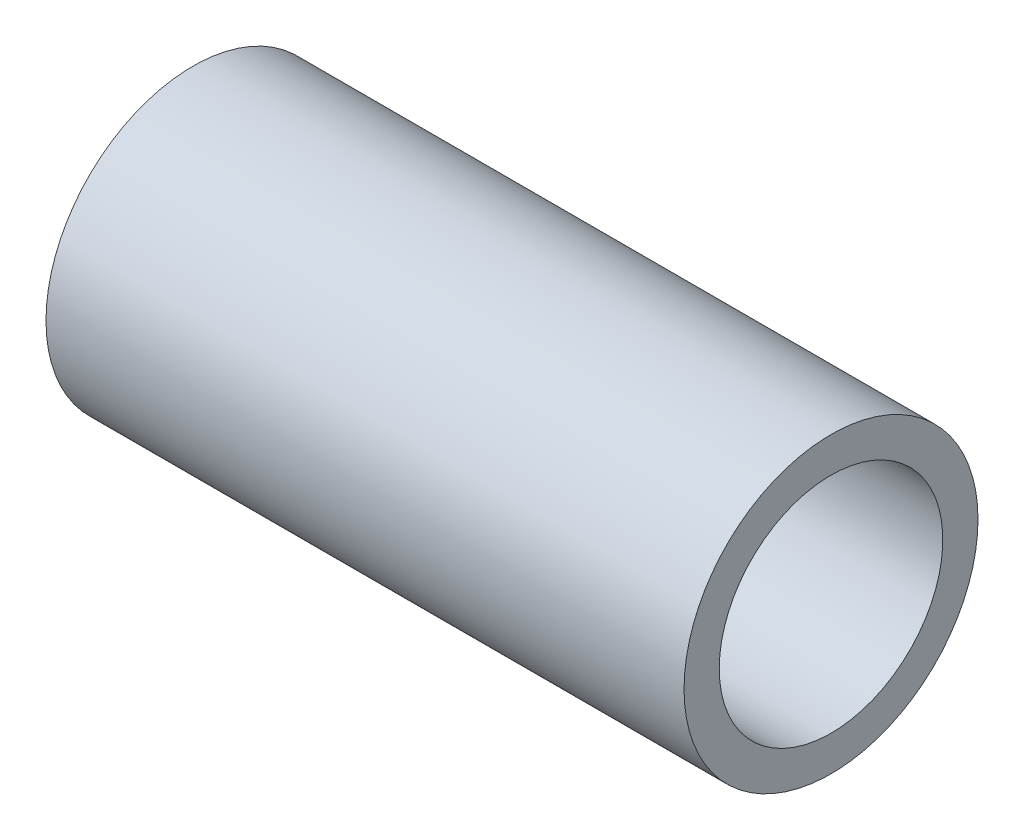
ISO-10303-21;
HEADER;
FILE_DESCRIPTION(('STEP AP214'),'2;1');
FILE_NAME('part.step','',(''),(''),'','','');
FILE_SCHEMA(('AUTOMOTIVE_DESIGN { 1 0 10303 214 1 1 1 1 }'));
ENDSEC;
DATA;
#1=APPLICATION_CONTEXT('core data for automotive mechanical design processes');
#2=APPLICATION_PROTOCOL_DEFINITION('international standard','automotive_design',2000,#1);
#3=PRODUCT_CONTEXT('',#1,'mechanical');
#4=PRODUCT('Part','Part','',(#3));
#5=PRODUCT_RELATED_PRODUCT_CATEGORY('part','',(#4));
#6=PRODUCT_DEFINITION_FORMATION('','',#4);
#7=PRODUCT_DEFINITION_CONTEXT('part definition',#1,'design');
#8=PRODUCT_DEFINITION('design','',#6,#7);
#9=PRODUCT_DEFINITION_SHAPE('','',#8);
#10=(LENGTH_UNIT() NAMED_UNIT(*) SI_UNIT(.MILLI.,.METRE.));
#11=(NAMED_UNIT(*) PLANE_ANGLE_UNIT() SI_UNIT($,.RADIAN.));
#12=(NAMED_UNIT(*) SI_UNIT($,.STERADIAN.) SOLID_ANGLE_UNIT());
#13=UNCERTAINTY_MEASURE_WITH_UNIT(LENGTH_MEASURE(1.E-05),#10,'distance_accuracy_value','');
#14=(GEOMETRIC_REPRESENTATION_CONTEXT(3) GLOBAL_UNCERTAINTY_ASSIGNED_CONTEXT((#13)) GLOBAL_UNIT_ASSIGNED_CONTEXT((#10,
#11,#12)) REPRESENTATION_CONTEXT('',''));
#15=CARTESIAN_POINT('',(0.,0.,0.));
#16=DIRECTION('',(0.,0.,1.));
#17=DIRECTION('',(1.,0.,0.));
#18=AXIS2_PLACEMENT_3D('',#15,#16,#17);
#19=CARTESIAN_POINT('',(48.514,0.,0.));
#20=DIRECTION('',(-1.,0.,0.));
#21=DIRECTION('',(0.,0.,1.));
#22=AXIS2_PLACEMENT_3D('',#19,#20,#21);
#23=CYLINDRICAL_SURFACE('',#22,8.5);
#24=CARTESIAN_POINT('',(0.,0.,0.));
#25=DIRECTION('',(-1.,0.,0.));
#26=DIRECTION('',(0.,0.,1.));
#27=AXIS2_PLACEMENT_3D('',#24,#25,#26);
#28=CIRCLE('',#27,8.5);
#29=CARTESIAN_POINT('',(0.,0.,8.5));
#30=VERTEX_POINT('',#29);
#31=EDGE_CURVE('E26',#30,#30,#28,.T.);
#32=ORIENTED_EDGE('',*,*,#31,.T.);
#33=EDGE_LOOP('',(#32));
#34=FACE_BOUND('',#33,.T.);
#35=CARTESIAN_POINT('',(48.514,0.,0.));
#36=DIRECTION('',(-1.,0.,0.));
#37=DIRECTION('',(0.,0.,1.));
#38=AXIS2_PLACEMENT_3D('',#35,#36,#37);
#39=CIRCLE('',#38,8.5);
#40=CARTESIAN_POINT('',(48.514,0.,8.5));
#41=VERTEX_POINT('',#40);
#42=EDGE_CURVE('E17',#41,#41,#39,.T.);
#43=ORIENTED_EDGE('',*,*,#42,.F.);
#44=EDGE_LOOP('',(#43));
#45=FACE_BOUND('',#44,.T.);
#46=ADVANCED_FACE('F14',(#34,#45),#23,.F.);
#47=CARTESIAN_POINT('',(48.514,0.,0.));
#48=DIRECTION('',(1.,0.,0.));
#49=DIRECTION('',(0.,0.,-1.));
#50=AXIS2_PLACEMENT_3D('',#47,#48,#49);
#51=PLANE('',#50);
#52=ORIENTED_EDGE('',*,*,#42,.T.);
#53=EDGE_LOOP('',(#52));
#54=FACE_BOUND('',#53,.T.);
#55=CARTESIAN_POINT('',(48.514,0.,0.));
#56=DIRECTION('',(-1.,0.,0.));
#57=DIRECTION('',(0.,0.,1.));
#58=AXIS2_PLACEMENT_3D('',#55,#56,#57);
#59=CIRCLE('',#58,11.176);
#60=CARTESIAN_POINT('',(48.514,0.,11.176));
#61=VERTEX_POINT('',#60);
#62=EDGE_CURVE('E21',#61,#61,#59,.T.);
#63=ORIENTED_EDGE('',*,*,#62,.F.);
#64=EDGE_LOOP('',(#63));
#65=FACE_BOUND('',#64,.T.);
#66=ADVANCED_FACE('F34',(#54,#65),#51,.T.);
#67=CARTESIAN_POINT('',(0.,0.,0.));
#68=DIRECTION('',(1.,0.,0.));
#69=DIRECTION('',(0.,0.,-1.));
#70=AXIS2_PLACEMENT_3D('',#67,#68,#69);
#71=PLANE('',#70);
#72=ORIENTED_EDGE('',*,*,#31,.F.);
#73=EDGE_LOOP('',(#72));
#74=FACE_BOUND('',#73,.T.);
#75=CARTESIAN_POINT('',(0.,0.,0.));
#76=DIRECTION('',(-1.,0.,0.));
#77=DIRECTION('',(0.,0.,1.));
#78=AXIS2_PLACEMENT_3D('',#75,#76,#77);
#79=CIRCLE('',#78,11.176);
#80=CARTESIAN_POINT('',(0.,0.,11.176));
#81=VERTEX_POINT('',#80);
#82=EDGE_CURVE('E10',#81,#81,#79,.F.);
#83=ORIENTED_EDGE('',*,*,#82,.F.);
#84=EDGE_LOOP('',(#83));
#85=FACE_BOUND('',#84,.T.);
#86=ADVANCED_FACE('F42',(#74,#85),#71,.F.);
#87=CARTESIAN_POINT('',(48.514,0.,0.));
#88=DIRECTION('',(-1.,0.,0.));
#89=DIRECTION('',(0.,0.,1.));
#90=AXIS2_PLACEMENT_3D('',#87,#88,#89);
#91=CYLINDRICAL_SURFACE('',#90,11.176);
#92=ORIENTED_EDGE('',*,*,#82,.T.);
#93=EDGE_LOOP('',(#92));
#94=FACE_BOUND('',#93,.T.);
#95=ORIENTED_EDGE('',*,*,#62,.T.);
#96=EDGE_LOOP('',(#95));
#97=FACE_BOUND('',#96,.T.);
#98=ADVANCED_FACE('F43',(#94,#97),#91,.T.);
#99=CLOSED_SHELL('',(#46,#66,#86,#98));
#100=MANIFOLD_SOLID_BREP('B1',#99);
#101=ADVANCED_BREP_SHAPE_REPRESENTATION('',(#18,#100),#14);
#102=SHAPE_DEFINITION_REPRESENTATION(#9,#101);
ENDSEC;
END-ISO-10303-21;
